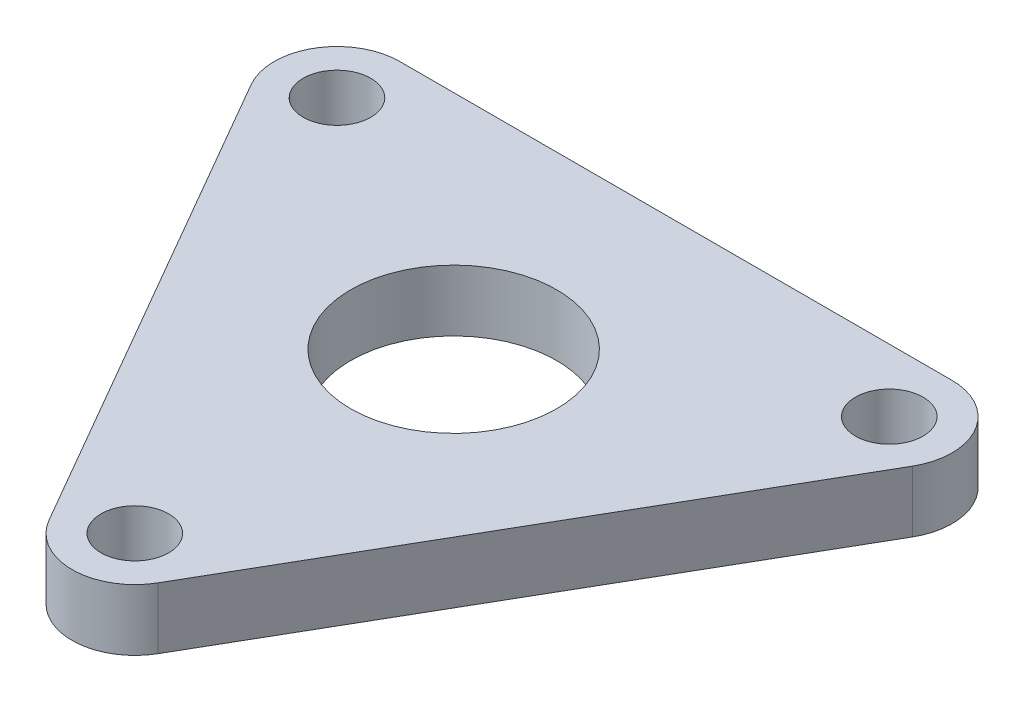
ISO-10303-21;
HEADER;
FILE_DESCRIPTION(('STEP AP214'),'2;1');
FILE_NAME('part.step','',(''),(''),'','','');
FILE_SCHEMA(('AUTOMOTIVE_DESIGN { 1 0 10303 214 1 1 1 1 }'));
ENDSEC;
DATA;
#1=APPLICATION_CONTEXT('core data for automotive mechanical design processes');
#2=APPLICATION_PROTOCOL_DEFINITION('international standard','automotive_design',2000,#1);
#3=PRODUCT_CONTEXT('',#1,'mechanical');
#4=PRODUCT('Part','Part','',(#3));
#5=PRODUCT_RELATED_PRODUCT_CATEGORY('part','',(#4));
#6=PRODUCT_DEFINITION_FORMATION('','',#4);
#7=PRODUCT_DEFINITION_CONTEXT('part definition',#1,'design');
#8=PRODUCT_DEFINITION('design','',#6,#7);
#9=PRODUCT_DEFINITION_SHAPE('','',#8);
#10=(LENGTH_UNIT() NAMED_UNIT(*) SI_UNIT(.MILLI.,.METRE.));
#11=(NAMED_UNIT(*) PLANE_ANGLE_UNIT() SI_UNIT($,.RADIAN.));
#12=(NAMED_UNIT(*) SI_UNIT($,.STERADIAN.) SOLID_ANGLE_UNIT());
#13=UNCERTAINTY_MEASURE_WITH_UNIT(LENGTH_MEASURE(1.E-05),#10,'distance_accuracy_value','');
#14=(GEOMETRIC_REPRESENTATION_CONTEXT(3) GLOBAL_UNCERTAINTY_ASSIGNED_CONTEXT((#13)) GLOBAL_UNIT_ASSIGNED_CONTEXT((#10,
#11,#12)) REPRESENTATION_CONTEXT('',''));
#15=CARTESIAN_POINT('',(0.,0.,0.));
#16=DIRECTION('',(0.,0.,1.));
#17=DIRECTION('',(1.,0.,0.));
#18=AXIS2_PLACEMENT_3D('',#15,#16,#17);
#19=CARTESIAN_POINT('',(-14.2894191624432,3.175,-8.25));
#20=DIRECTION('',(0.,1.,0.));
#21=DIRECTION('',(0.,0.,1.));
#22=AXIS2_PLACEMENT_3D('',#19,#20,#21);
#23=PLANE('',#22);
#24=CARTESIAN_POINT('',(0.,3.175,16.5));
#25=DIRECTION('',(0.,1.,0.));
#26=DIRECTION('',(0.,0.,1.));
#27=AXIS2_PLACEMENT_3D('',#24,#25,#26);
#28=CIRCLE('',#27,1.75);
#29=CARTESIAN_POINT('',(0.,3.175,18.25));
#30=VERTEX_POINT('',#29);
#31=EDGE_CURVE('E194',#30,#30,#28,.T.);
#32=ORIENTED_EDGE('',*,*,#31,.F.);
#33=EDGE_LOOP('',(#32));
#34=FACE_BOUND('',#33,.T.);
#35=CARTESIAN_POINT('',(0.,3.175,0.));
#36=DIRECTION('',(0.,1.,0.));
#37=DIRECTION('',(0.,0.,1.));
#38=AXIS2_PLACEMENT_3D('',#35,#36,#37);
#39=CIRCLE('',#38,5.334);
#40=CARTESIAN_POINT('',(0.,3.175,5.334));
#41=VERTEX_POINT('',#40);
#42=EDGE_CURVE('E126',#41,#41,#39,.T.);
#43=ORIENTED_EDGE('',*,*,#42,.F.);
#44=EDGE_LOOP('',(#43));
#45=FACE_BOUND('',#44,.T.);
#46=CARTESIAN_POINT('',(-14.2894191624432,3.175,-8.25));
#47=DIRECTION('',(0.,1.,0.));
#48=DIRECTION('',(0.,0.,1.));
#49=AXIS2_PLACEMENT_3D('',#46,#47,#48);
#50=CIRCLE('',#49,3.25);
#51=CARTESIAN_POINT('',(-14.2894191624432,3.175,-11.5));
#52=VERTEX_POINT('',#51);
#53=CARTESIAN_POINT('',(-17.1040017247427,3.175,-6.625));
#54=VERTEX_POINT('',#53);
#55=EDGE_CURVE('E133',#52,#54,#50,.T.);
#56=ORIENTED_EDGE('',*,*,#55,.T.);
#57=DIRECTION('',(0.5,0.,0.866025403784438));
#58=VECTOR('',#57,1.);
#59=CARTESIAN_POINT('',(-17.1040017247427,3.175,-6.625));
#60=LINE('',#59,#58);
#61=CARTESIAN_POINT('',(-2.81458256229942,3.175,18.125));
#62=VERTEX_POINT('',#61);
#63=EDGE_CURVE('E91',#54,#62,#60,.T.);
#64=ORIENTED_EDGE('',*,*,#63,.T.);
#65=CARTESIAN_POINT('',(0.,3.175,16.5));
#66=DIRECTION('',(0.,1.,0.));
#67=DIRECTION('',(0.,0.,1.));
#68=AXIS2_PLACEMENT_3D('',#65,#66,#67);
#69=CIRCLE('',#68,3.25);
#70=CARTESIAN_POINT('',(2.81458256229942,3.175,18.125));
#71=VERTEX_POINT('',#70);
#72=EDGE_CURVE('E104',#62,#71,#69,.T.);
#73=ORIENTED_EDGE('',*,*,#72,.T.);
#74=DIRECTION('',(0.5,0.,-0.866025403784438));
#75=VECTOR('',#74,1.);
#76=CARTESIAN_POINT('',(2.81458256229942,3.175,18.125));
#77=LINE('',#76,#75);
#78=CARTESIAN_POINT('',(17.1040017247427,3.175,-6.625));
#79=VERTEX_POINT('',#78);
#80=EDGE_CURVE('E98',#71,#79,#77,.T.);
#81=ORIENTED_EDGE('',*,*,#80,.T.);
#82=CARTESIAN_POINT('',(14.2894191624432,3.175,-8.25));
#83=DIRECTION('',(0.,1.,0.));
#84=DIRECTION('',(0.,0.,1.));
#85=AXIS2_PLACEMENT_3D('',#82,#83,#84);
#86=CIRCLE('',#85,3.25);
#87=CARTESIAN_POINT('',(14.2894191624432,3.175,-11.5));
#88=VERTEX_POINT('',#87);
#89=EDGE_CURVE('E102',#79,#88,#86,.T.);
#90=ORIENTED_EDGE('',*,*,#89,.T.);
#91=DIRECTION('',(-1.,0.,0.));
#92=VECTOR('',#91,1.);
#93=CARTESIAN_POINT('',(-14.2894191624432,3.175,-11.5));
#94=LINE('',#93,#92);
#95=EDGE_CURVE('E54',#88,#52,#94,.T.);
#96=ORIENTED_EDGE('',*,*,#95,.T.);
#97=EDGE_LOOP('',(#56,#64,#73,#81,#90,#96));
#98=FACE_BOUND('',#97,.T.);
#99=CARTESIAN_POINT('',(-14.2894191624432,3.175,-8.25));
#100=DIRECTION('',(0.,1.,0.));
#101=DIRECTION('',(0.,0.,1.));
#102=AXIS2_PLACEMENT_3D('',#99,#100,#101);
#103=CIRCLE('',#102,1.75);
#104=CARTESIAN_POINT('',(-14.2894191624432,3.175,-6.5));
#105=VERTEX_POINT('',#104);
#106=EDGE_CURVE('E200',#105,#105,#103,.T.);
#107=ORIENTED_EDGE('',*,*,#106,.F.);
#108=EDGE_LOOP('',(#107));
#109=FACE_BOUND('',#108,.T.);
#110=CARTESIAN_POINT('',(14.2894191624432,3.175,-8.25));
#111=DIRECTION('',(0.,1.,0.));
#112=DIRECTION('',(0.,0.,1.));
#113=AXIS2_PLACEMENT_3D('',#110,#111,#112);
#114=CIRCLE('',#113,1.75);
#115=CARTESIAN_POINT('',(14.2894191624432,3.175,-6.5));
#116=VERTEX_POINT('',#115);
#117=EDGE_CURVE('E185',#116,#116,#114,.T.);
#118=ORIENTED_EDGE('',*,*,#117,.F.);
#119=EDGE_LOOP('',(#118));
#120=FACE_BOUND('',#119,.T.);
#121=ADVANCED_FACE('F37',(#34,#45,#98,#109,#120),#23,.T.);
#122=CARTESIAN_POINT('',(-14.2894191624432,0.,-8.25));
#123=DIRECTION('',(0.,1.,0.));
#124=DIRECTION('',(0.,0.,1.));
#125=AXIS2_PLACEMENT_3D('',#122,#123,#124);
#126=PLANE('',#125);
#127=CARTESIAN_POINT('',(0.,0.,16.5));
#128=DIRECTION('',(0.,1.,0.));
#129=DIRECTION('',(0.,0.,1.));
#130=AXIS2_PLACEMENT_3D('',#127,#128,#129);
#131=CIRCLE('',#130,1.75);
#132=CARTESIAN_POINT('',(0.,0.,18.25));
#133=VERTEX_POINT('',#132);
#134=EDGE_CURVE('E191',#133,#133,#131,.T.);
#135=ORIENTED_EDGE('',*,*,#134,.T.);
#136=EDGE_LOOP('',(#135));
#137=FACE_BOUND('',#136,.T.);
#138=CARTESIAN_POINT('',(0.,0.,0.));
#139=DIRECTION('',(0.,1.,0.));
#140=DIRECTION('',(0.,0.,1.));
#141=AXIS2_PLACEMENT_3D('',#138,#139,#140);
#142=CIRCLE('',#141,5.334);
#143=CARTESIAN_POINT('',(0.,0.,5.334));
#144=VERTEX_POINT('',#143);
#145=EDGE_CURVE('E203',#144,#144,#142,.T.);
#146=ORIENTED_EDGE('',*,*,#145,.T.);
#147=EDGE_LOOP('',(#146));
#148=FACE_BOUND('',#147,.T.);
#149=CARTESIAN_POINT('',(-14.2894191624432,0.,-8.25));
#150=DIRECTION('',(0.,1.,0.));
#151=DIRECTION('',(0.,0.,1.));
#152=AXIS2_PLACEMENT_3D('',#149,#150,#151);
#153=CIRCLE('',#152,3.25);
#154=CARTESIAN_POINT('',(-14.2894191624432,0.,-11.5));
#155=VERTEX_POINT('',#154);
#156=CARTESIAN_POINT('',(-17.1040017247427,0.,-6.625));
#157=VERTEX_POINT('',#156);
#158=EDGE_CURVE('E122',#155,#157,#153,.T.);
#159=ORIENTED_EDGE('',*,*,#158,.F.);
#160=DIRECTION('',(-1.,0.,0.));
#161=VECTOR('',#160,1.);
#162=CARTESIAN_POINT('',(-14.2894191624432,0.,-11.5));
#163=LINE('',#162,#161);
#164=CARTESIAN_POINT('',(14.2894191624432,0.,-11.5));
#165=VERTEX_POINT('',#164);
#166=EDGE_CURVE('E83',#165,#155,#163,.T.);
#167=ORIENTED_EDGE('',*,*,#166,.F.);
#168=CARTESIAN_POINT('',(14.2894191624432,0.,-8.25));
#169=DIRECTION('',(0.,1.,0.));
#170=DIRECTION('',(0.,0.,1.));
#171=AXIS2_PLACEMENT_3D('',#168,#169,#170);
#172=CIRCLE('',#171,3.25);
#173=CARTESIAN_POINT('',(17.1040017247427,0.,-6.625));
#174=VERTEX_POINT('',#173);
#175=EDGE_CURVE('E77',#174,#165,#172,.T.);
#176=ORIENTED_EDGE('',*,*,#175,.F.);
#177=DIRECTION('',(0.5,0.,-0.866025403784438));
#178=VECTOR('',#177,1.);
#179=CARTESIAN_POINT('',(2.81458256229942,0.,18.125));
#180=LINE('',#179,#178);
#181=CARTESIAN_POINT('',(2.81458256229942,0.,18.125));
#182=VERTEX_POINT('',#181);
#183=EDGE_CURVE('E112',#182,#174,#180,.T.);
#184=ORIENTED_EDGE('',*,*,#183,.F.);
#185=CARTESIAN_POINT('',(0.,0.,16.5));
#186=DIRECTION('',(0.,1.,0.));
#187=DIRECTION('',(0.,0.,1.));
#188=AXIS2_PLACEMENT_3D('',#185,#186,#187);
#189=CIRCLE('',#188,3.25);
#190=CARTESIAN_POINT('',(-2.81458256229942,0.,18.125));
#191=VERTEX_POINT('',#190);
#192=EDGE_CURVE('E128',#191,#182,#189,.T.);
#193=ORIENTED_EDGE('',*,*,#192,.F.);
#194=DIRECTION('',(0.5,0.,0.866025403784438));
#195=VECTOR('',#194,1.);
#196=CARTESIAN_POINT('',(-17.1040017247427,0.,-6.625));
#197=LINE('',#196,#195);
#198=EDGE_CURVE('E125',#157,#191,#197,.T.);
#199=ORIENTED_EDGE('',*,*,#198,.F.);
#200=EDGE_LOOP('',(#159,#167,#176,#184,#193,#199));
#201=FACE_BOUND('',#200,.T.);
#202=CARTESIAN_POINT('',(-14.2894191624432,0.,-8.25));
#203=DIRECTION('',(0.,1.,0.));
#204=DIRECTION('',(0.,0.,1.));
#205=AXIS2_PLACEMENT_3D('',#202,#203,#204);
#206=CIRCLE('',#205,1.75);
#207=CARTESIAN_POINT('',(-14.2894191624432,0.,-6.5));
#208=VERTEX_POINT('',#207);
#209=EDGE_CURVE('E197',#208,#208,#206,.T.);
#210=ORIENTED_EDGE('',*,*,#209,.T.);
#211=EDGE_LOOP('',(#210));
#212=FACE_BOUND('',#211,.T.);
#213=CARTESIAN_POINT('',(14.2894191624432,0.,-8.25));
#214=DIRECTION('',(0.,1.,0.));
#215=DIRECTION('',(0.,0.,1.));
#216=AXIS2_PLACEMENT_3D('',#213,#214,#215);
#217=CIRCLE('',#216,1.75);
#218=CARTESIAN_POINT('',(14.2894191624432,0.,-6.5));
#219=VERTEX_POINT('',#218);
#220=EDGE_CURVE('E188',#219,#219,#217,.T.);
#221=ORIENTED_EDGE('',*,*,#220,.T.);
#222=EDGE_LOOP('',(#221));
#223=FACE_BOUND('',#222,.T.);
#224=ADVANCED_FACE('F142',(#137,#148,#201,#212,#223),#126,.F.);
#225=CARTESIAN_POINT('',(-14.2894191624432,3.175,-8.25));
#226=DIRECTION('',(0.,-1.,0.));
#227=DIRECTION('',(0.,0.,-1.));
#228=AXIS2_PLACEMENT_3D('',#225,#226,#227);
#229=CYLINDRICAL_SURFACE('',#228,3.25);
#230=ORIENTED_EDGE('',*,*,#158,.T.);
#231=DIRECTION('',(0.,-1.,0.));
#232=VECTOR('',#231,1.);
#233=CARTESIAN_POINT('',(-17.1040017247427,3.175,-6.625));
#234=LINE('',#233,#232);
#235=EDGE_CURVE('E11',#54,#157,#234,.T.);
#236=ORIENTED_EDGE('',*,*,#235,.F.);
#237=ORIENTED_EDGE('',*,*,#55,.F.);
#238=DIRECTION('',(0.,-1.,0.));
#239=VECTOR('',#238,1.);
#240=CARTESIAN_POINT('',(-14.2894191624432,3.175,-11.5));
#241=LINE('',#240,#239);
#242=EDGE_CURVE('E118',#52,#155,#241,.T.);
#243=ORIENTED_EDGE('',*,*,#242,.T.);
#244=EDGE_LOOP('',(#230,#236,#237,#243));
#245=FACE_BOUND('',#244,.T.);
#246=ADVANCED_FACE('F39',(#245),#229,.T.);
#247=CARTESIAN_POINT('',(-17.1040017247427,3.175,-6.625));
#248=DIRECTION('',(0.866025403784438,0.,-0.5));
#249=DIRECTION('',(-0.5,0.,-0.866025403784439));
#250=AXIS2_PLACEMENT_3D('',#247,#248,#249);
#251=PLANE('',#250);
#252=ORIENTED_EDGE('',*,*,#198,.T.);
#253=DIRECTION('',(0.,-1.,0.));
#254=VECTOR('',#253,1.);
#255=CARTESIAN_POINT('',(-2.81458256229942,3.175,18.125));
#256=LINE('',#255,#254);
#257=EDGE_CURVE('E46',#62,#191,#256,.T.);
#258=ORIENTED_EDGE('',*,*,#257,.F.);
#259=ORIENTED_EDGE('',*,*,#63,.F.);
#260=ORIENTED_EDGE('',*,*,#235,.T.);
#261=EDGE_LOOP('',(#252,#258,#259,#260));
#262=FACE_BOUND('',#261,.T.);
#263=ADVANCED_FACE('F260',(#262),#251,.F.);
#264=CARTESIAN_POINT('',(0.,3.175,16.5));
#265=DIRECTION('',(0.,-1.,0.));
#266=DIRECTION('',(0.,0.,-1.));
#267=AXIS2_PLACEMENT_3D('',#264,#265,#266);
#268=CYLINDRICAL_SURFACE('',#267,3.25);
#269=ORIENTED_EDGE('',*,*,#192,.T.);
#270=DIRECTION('',(0.,-1.,0.));
#271=VECTOR('',#270,1.);
#272=CARTESIAN_POINT('',(2.81458256229942,3.175,18.125));
#273=LINE('',#272,#271);
#274=EDGE_CURVE('E113',#71,#182,#273,.T.);
#275=ORIENTED_EDGE('',*,*,#274,.F.);
#276=ORIENTED_EDGE('',*,*,#72,.F.);
#277=ORIENTED_EDGE('',*,*,#257,.T.);
#278=EDGE_LOOP('',(#269,#275,#276,#277));
#279=FACE_BOUND('',#278,.T.);
#280=ADVANCED_FACE('F139',(#279),#268,.T.);
#281=CARTESIAN_POINT('',(2.81458256229942,3.175,18.125));
#282=DIRECTION('',(-0.866025403784438,0.,-0.5));
#283=DIRECTION('',(-0.5,0.,0.866025403784439));
#284=AXIS2_PLACEMENT_3D('',#281,#282,#283);
#285=PLANE('',#284);
#286=ORIENTED_EDGE('',*,*,#183,.T.);
#287=DIRECTION('',(0.,-1.,0.));
#288=VECTOR('',#287,1.);
#289=CARTESIAN_POINT('',(17.1040017247427,3.175,-6.625));
#290=LINE('',#289,#288);
#291=EDGE_CURVE('E109',#79,#174,#290,.T.);
#292=ORIENTED_EDGE('',*,*,#291,.F.);
#293=ORIENTED_EDGE('',*,*,#80,.F.);
#294=ORIENTED_EDGE('',*,*,#274,.T.);
#295=EDGE_LOOP('',(#286,#292,#293,#294));
#296=FACE_BOUND('',#295,.T.);
#297=ADVANCED_FACE('F110',(#296),#285,.F.);
#298=CARTESIAN_POINT('',(14.2894191624432,3.175,-8.25));
#299=DIRECTION('',(0.,-1.,0.));
#300=DIRECTION('',(0.,0.,-1.));
#301=AXIS2_PLACEMENT_3D('',#298,#299,#300);
#302=CYLINDRICAL_SURFACE('',#301,3.25);
#303=ORIENTED_EDGE('',*,*,#175,.T.);
#304=DIRECTION('',(0.,-1.,0.));
#305=VECTOR('',#304,1.);
#306=CARTESIAN_POINT('',(14.2894191624432,3.175,-11.5));
#307=LINE('',#306,#305);
#308=EDGE_CURVE('E114',#88,#165,#307,.T.);
#309=ORIENTED_EDGE('',*,*,#308,.F.);
#310=ORIENTED_EDGE('',*,*,#89,.F.);
#311=ORIENTED_EDGE('',*,*,#291,.T.);
#312=EDGE_LOOP('',(#303,#309,#310,#311));
#313=FACE_BOUND('',#312,.T.);
#314=ADVANCED_FACE('F116',(#313),#302,.T.);
#315=CARTESIAN_POINT('',(-14.2894191624432,3.175,-11.5));
#316=DIRECTION('',(0.,0.,1.));
#317=DIRECTION('',(1.,0.,0.));
#318=AXIS2_PLACEMENT_3D('',#315,#316,#317);
#319=PLANE('',#318);
#320=ORIENTED_EDGE('',*,*,#166,.T.);
#321=ORIENTED_EDGE('',*,*,#242,.F.);
#322=ORIENTED_EDGE('',*,*,#95,.F.);
#323=ORIENTED_EDGE('',*,*,#308,.T.);
#324=EDGE_LOOP('',(#320,#321,#322,#323));
#325=FACE_BOUND('',#324,.T.);
#326=ADVANCED_FACE('F147',(#325),#319,.F.);
#327=CARTESIAN_POINT('',(0.,3.175,0.));
#328=DIRECTION('',(0.,-1.,0.));
#329=DIRECTION('',(0.,0.,-1.));
#330=AXIS2_PLACEMENT_3D('',#327,#328,#329);
#331=CYLINDRICAL_SURFACE('',#330,5.334);
#332=ORIENTED_EDGE('',*,*,#42,.T.);
#333=EDGE_LOOP('',(#332));
#334=FACE_BOUND('',#333,.T.);
#335=ORIENTED_EDGE('',*,*,#145,.F.);
#336=EDGE_LOOP('',(#335));
#337=FACE_BOUND('',#336,.T.);
#338=ADVANCED_FACE('F149',(#334,#337),#331,.F.);
#339=CARTESIAN_POINT('',(-14.2894191624432,3.175,-8.25));
#340=DIRECTION('',(0.,-1.,0.));
#341=DIRECTION('',(0.,0.,-1.));
#342=AXIS2_PLACEMENT_3D('',#339,#340,#341);
#343=CYLINDRICAL_SURFACE('',#342,1.75);
#344=ORIENTED_EDGE('',*,*,#106,.T.);
#345=EDGE_LOOP('',(#344));
#346=FACE_BOUND('',#345,.T.);
#347=ORIENTED_EDGE('',*,*,#209,.F.);
#348=EDGE_LOOP('',(#347));
#349=FACE_BOUND('',#348,.T.);
#350=ADVANCED_FACE('F155',(#346,#349),#343,.F.);
#351=CARTESIAN_POINT('',(0.,3.175,16.5));
#352=DIRECTION('',(0.,-1.,0.));
#353=DIRECTION('',(0.,0.,-1.));
#354=AXIS2_PLACEMENT_3D('',#351,#352,#353);
#355=CYLINDRICAL_SURFACE('',#354,1.75);
#356=ORIENTED_EDGE('',*,*,#31,.T.);
#357=EDGE_LOOP('',(#356));
#358=FACE_BOUND('',#357,.T.);
#359=ORIENTED_EDGE('',*,*,#134,.F.);
#360=EDGE_LOOP('',(#359));
#361=FACE_BOUND('',#360,.T.);
#362=ADVANCED_FACE('F172',(#358,#361),#355,.F.);
#363=CARTESIAN_POINT('',(14.2894191624432,3.175,-8.25));
#364=DIRECTION('',(0.,-1.,0.));
#365=DIRECTION('',(0.,0.,-1.));
#366=AXIS2_PLACEMENT_3D('',#363,#364,#365);
#367=CYLINDRICAL_SURFACE('',#366,1.75);
#368=ORIENTED_EDGE('',*,*,#117,.T.);
#369=EDGE_LOOP('',(#368));
#370=FACE_BOUND('',#369,.T.);
#371=ORIENTED_EDGE('',*,*,#220,.F.);
#372=EDGE_LOOP('',(#371));
#373=FACE_BOUND('',#372,.T.);
#374=ADVANCED_FACE('F176',(#370,#373),#367,.F.);
#375=CLOSED_SHELL('',(#121,#224,#246,#263,#280,#297,#314,#326,#338,#350,#362,#374));
#376=MANIFOLD_SOLID_BREP('B2',#375);
#377=ADVANCED_BREP_SHAPE_REPRESENTATION('',(#18,#376),#14);
#378=SHAPE_DEFINITION_REPRESENTATION(#9,#377);
ENDSEC;
END-ISO-10303-21;
